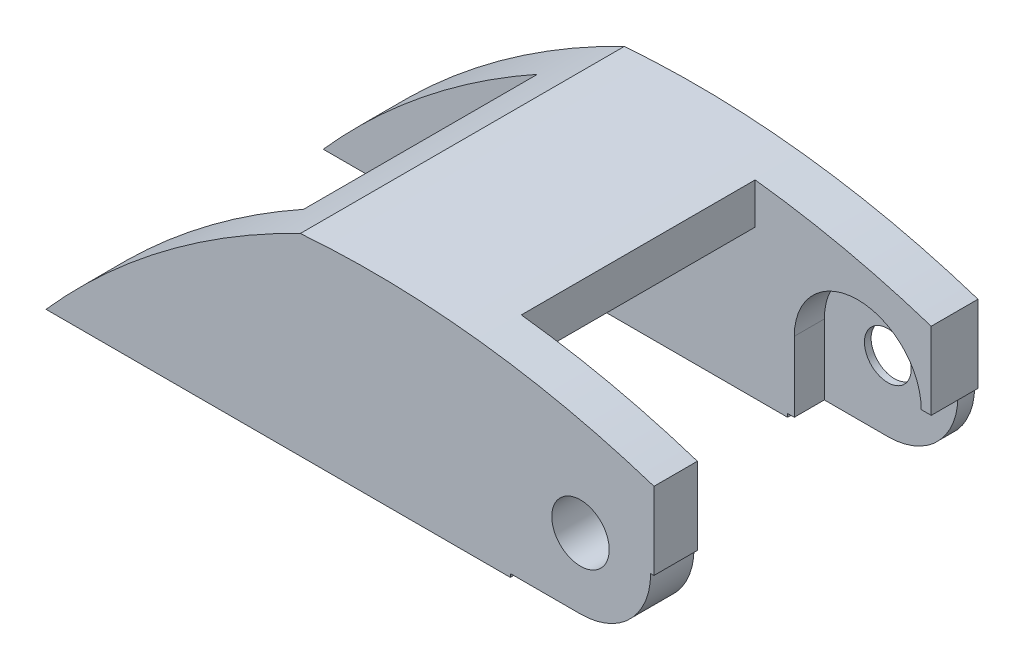
ISO-10303-21;
HEADER;
FILE_DESCRIPTION(('STEP AP214'),'2;1');
FILE_NAME('part.step','',(''),(''),'','','');
FILE_SCHEMA(('AUTOMOTIVE_DESIGN { 1 0 10303 214 1 1 1 1 }'));
ENDSEC;
DATA;
#1=APPLICATION_CONTEXT('core data for automotive mechanical design processes');
#2=APPLICATION_PROTOCOL_DEFINITION('international standard','automotive_design',2000,#1);
#3=PRODUCT_CONTEXT('',#1,'mechanical');
#4=PRODUCT('Part','Part','',(#3));
#5=PRODUCT_RELATED_PRODUCT_CATEGORY('part','',(#4));
#6=PRODUCT_DEFINITION_FORMATION('','',#4);
#7=PRODUCT_DEFINITION_CONTEXT('part definition',#1,'design');
#8=PRODUCT_DEFINITION('design','',#6,#7);
#9=PRODUCT_DEFINITION_SHAPE('','',#8);
#10=(LENGTH_UNIT() NAMED_UNIT(*) SI_UNIT(.MILLI.,.METRE.));
#11=(NAMED_UNIT(*) PLANE_ANGLE_UNIT() SI_UNIT($,.RADIAN.));
#12=(NAMED_UNIT(*) SI_UNIT($,.STERADIAN.) SOLID_ANGLE_UNIT());
#13=UNCERTAINTY_MEASURE_WITH_UNIT(LENGTH_MEASURE(1.E-05),#10,'distance_accuracy_value','');
#14=(GEOMETRIC_REPRESENTATION_CONTEXT(3) GLOBAL_UNCERTAINTY_ASSIGNED_CONTEXT((#13)) GLOBAL_UNIT_ASSIGNED_CONTEXT((#10,
#11,#12)) REPRESENTATION_CONTEXT('',''));
#15=CARTESIAN_POINT('',(0.,0.,0.));
#16=DIRECTION('',(0.,0.,1.));
#17=DIRECTION('',(1.,0.,0.));
#18=AXIS2_PLACEMENT_3D('',#15,#16,#17);
#19=CARTESIAN_POINT('',(0.,0.,-75.3));
#20=DIRECTION('',(0.,0.,-1.));
#21=DIRECTION('',(-1.,0.,0.));
#22=AXIS2_PLACEMENT_3D('',#19,#20,#21);
#23=CYLINDRICAL_SURFACE('',#22,3.5);
#24=CARTESIAN_POINT('',(0.,0.,-94.5));
#25=DIRECTION('',(0.,0.,1.));
#26=DIRECTION('',(0.,-1.,0.));
#27=AXIS2_PLACEMENT_3D('',#24,#25,#26);
#28=CIRCLE('',#27,3.5);
#29=CARTESIAN_POINT('',(0.,-3.5,-94.5));
#30=VERTEX_POINT('',#29);
#31=EDGE_CURVE('E53',#30,#30,#28,.T.);
#32=ORIENTED_EDGE('',*,*,#31,.T.);
#33=EDGE_LOOP('',(#32));
#34=FACE_BOUND('',#33,.T.);
#35=CARTESIAN_POINT('',(0.,0.,-95.5));
#36=DIRECTION('',(0.,0.,-1.));
#37=DIRECTION('',(-1.,0.,0.));
#38=AXIS2_PLACEMENT_3D('',#35,#36,#37);
#39=CIRCLE('',#38,3.5);
#40=CARTESIAN_POINT('',(-3.5,0.,-95.5));
#41=VERTEX_POINT('',#40);
#42=EDGE_CURVE('E234',#41,#41,#39,.F.);
#43=ORIENTED_EDGE('',*,*,#42,.F.);
#44=EDGE_LOOP('',(#43));
#45=FACE_BOUND('',#44,.T.);
#46=ADVANCED_FACE('F49',(#34,#45),#23,.F.);
#47=CARTESIAN_POINT('',(0.,-11.,-90.));
#48=DIRECTION('',(0.,1.,0.));
#49=DIRECTION('',(-1.,0.,0.));
#50=AXIS2_PLACEMENT_3D('',#47,#48,#49);
#51=PLANE('',#50);
#52=DIRECTION('',(0.,0.,-1.));
#53=VECTOR('',#52,1.);
#54=CARTESIAN_POINT('',(-10.5,-11.,-48.5));
#55=LINE('',#54,#53);
#56=CARTESIAN_POINT('',(-10.5,-11.,-48.5));
#57=VERTEX_POINT('',#56);
#58=CARTESIAN_POINT('',(-10.5,-11.,-55.));
#59=VERTEX_POINT('',#58);
#60=EDGE_CURVE('E352',#57,#59,#55,.T.);
#61=ORIENTED_EDGE('',*,*,#60,.F.);
#62=DIRECTION('',(-1.,0.,0.));
#63=VECTOR('',#62,1.);
#64=CARTESIAN_POINT('',(0.,-11.,-48.5));
#65=LINE('',#64,#63);
#66=CARTESIAN_POINT('',(-80.,-11.,-48.5));
#67=VERTEX_POINT('',#66);
#68=EDGE_CURVE('E444',#57,#67,#65,.T.);
#69=ORIENTED_EDGE('',*,*,#68,.T.);
#70=DIRECTION('',(0.,0.,-1.));
#71=VECTOR('',#70,1.);
#72=CARTESIAN_POINT('',(-80.,-11.,-90.));
#73=LINE('',#72,#71);
#74=CARTESIAN_POINT('',(-80.,-11.,-55.));
#75=VERTEX_POINT('',#74);
#76=EDGE_CURVE('E458',#67,#75,#73,.T.);
#77=ORIENTED_EDGE('',*,*,#76,.T.);
#78=DIRECTION('',(1.,0.,0.));
#79=VECTOR('',#78,1.);
#80=CARTESIAN_POINT('',(0.,-11.,-55.));
#81=LINE('',#80,#79);
#82=EDGE_CURVE('E436',#75,#59,#81,.T.);
#83=ORIENTED_EDGE('',*,*,#82,.T.);
#84=EDGE_LOOP('',(#61,#69,#77,#83));
#85=FACE_BOUND('',#84,.T.);
#86=ADVANCED_FACE('F531',(#85),#51,.F.);
#87=CARTESIAN_POINT('',(12.,-12.,-90.));
#88=DIRECTION('',(0.,0.,-1.));
#89=DIRECTION('',(0.,-1.,0.));
#90=AXIS2_PLACEMENT_3D('',#87,#88,#89);
#91=PLANE('',#90);
#92=CARTESIAN_POINT('',(0.,0.,-90.));
#93=DIRECTION('',(0.,0.,-1.));
#94=DIRECTION('',(0.,1.,0.));
#95=AXIS2_PLACEMENT_3D('',#92,#93,#94);
#96=CIRCLE('',#95,9.5);
#97=CARTESIAN_POINT('',(-9.5,0.,-90.));
#98=VERTEX_POINT('',#97);
#99=CARTESIAN_POINT('',(9.5,0.,-90.));
#100=VERTEX_POINT('',#99);
#101=EDGE_CURVE('E480',#98,#100,#96,.T.);
#102=ORIENTED_EDGE('',*,*,#101,.T.);
#103=DIRECTION('',(-1.,0.,0.));
#104=VECTOR('',#103,1.);
#105=CARTESIAN_POINT('',(12.,0.,-90.));
#106=LINE('',#105,#104);
#107=CARTESIAN_POINT('',(11.,0.,-90.));
#108=VERTEX_POINT('',#107);
#109=EDGE_CURVE('E369',#108,#100,#106,.T.);
#110=ORIENTED_EDGE('',*,*,#109,.F.);
#111=DIRECTION('',(0.,-1.,0.));
#112=VECTOR('',#111,1.);
#113=CARTESIAN_POINT('',(11.,-12.,-90.));
#114=LINE('',#113,#112);
#115=CARTESIAN_POINT('',(11.,11.56,-90.));
#116=VERTEX_POINT('',#115);
#117=EDGE_CURVE('E475',#116,#108,#114,.T.);
#118=ORIENTED_EDGE('',*,*,#117,.F.);
#119=CARTESIAN_POINT('',(-31.2492235347199,-117.890366828592,-90.));
#120=DIRECTION('',(0.,0.,-1.));
#121=DIRECTION('',(-1.,0.,0.));
#122=AXIS2_PLACEMENT_3D('',#119,#120,#121);
#123=CIRCLE('',#122,136.170460678312);
#124=CARTESIAN_POINT('',(-15.3528796517891,17.3490527668032,-90.));
#125=VERTEX_POINT('',#124);
#126=EDGE_CURVE('E403',#116,#125,#123,.F.);
#127=ORIENTED_EDGE('',*,*,#126,.T.);
#128=DIRECTION('',(0.,1.,0.));
#129=VECTOR('',#128,1.);
#130=CARTESIAN_POINT('',(-15.3528796517891,27.0048203954215,-90.));
#131=LINE('',#130,#129);
#132=CARTESIAN_POINT('',(-15.3528796517891,11.2297104142764,-90.));
#133=VERTEX_POINT('',#132);
#134=EDGE_CURVE('E380',#133,#125,#131,.T.);
#135=ORIENTED_EDGE('',*,*,#134,.F.);
#136=DIRECTION('',(-0.999921466953452,-0.0125323551520775,0.));
#137=VECTOR('',#136,1.);
#138=CARTESIAN_POINT('',(11.7046038405384,11.5688310390996,-90.));
#139=LINE('',#138,#137);
#140=CARTESIAN_POINT('',(-47.9438251540047,10.8212370318415,-90.));
#141=VERTEX_POINT('',#140);
#142=EDGE_CURVE('E414',#133,#141,#139,.T.);
#143=ORIENTED_EDGE('',*,*,#142,.T.);
#144=DIRECTION('',(0.,-1.,0.));
#145=VECTOR('',#144,1.);
#146=CARTESIAN_POINT('',(-47.9438251540047,23.2476872678202,-90.));
#147=LINE('',#146,#145);
#148=CARTESIAN_POINT('',(-47.9438251540047,14.7426625515026,-90.));
#149=VERTEX_POINT('',#148);
#150=EDGE_CURVE('E375',#149,#141,#147,.T.);
#151=ORIENTED_EDGE('',*,*,#150,.F.);
#152=CARTESIAN_POINT('',(11.,-91.4878048780488,-90.));
#153=DIRECTION('',(0.,0.,-1.));
#154=DIRECTION('',(-1.,0.,0.));
#155=AXIS2_PLACEMENT_3D('',#152,#153,#154);
#156=CIRCLE('',#155,121.487804878049);
#157=CARTESIAN_POINT('',(-80.,-11.,-90.));
#158=VERTEX_POINT('',#157);
#159=EDGE_CURVE('E392',#158,#149,#156,.T.);
#160=ORIENTED_EDGE('',*,*,#159,.F.);
#161=DIRECTION('',(-1.,0.,0.));
#162=VECTOR('',#161,1.);
#163=CARTESIAN_POINT('',(0.,-11.,-90.));
#164=LINE('',#163,#162);
#165=CARTESIAN_POINT('',(-10.5,-11.,-90.));
#166=VERTEX_POINT('',#165);
#167=EDGE_CURVE('E448',#166,#158,#164,.T.);
#168=ORIENTED_EDGE('',*,*,#167,.F.);
#169=DIRECTION('',(0.,-1.,0.));
#170=VECTOR('',#169,1.);
#171=CARTESIAN_POINT('',(-10.5,-12.,-90.));
#172=LINE('',#171,#170);
#173=CARTESIAN_POINT('',(-10.5,-10.5,-90.));
#174=VERTEX_POINT('',#173);
#175=EDGE_CURVE('E362',#174,#166,#172,.T.);
#176=ORIENTED_EDGE('',*,*,#175,.F.);
#177=DIRECTION('',(-1.,0.,0.));
#178=VECTOR('',#177,1.);
#179=CARTESIAN_POINT('',(12.,-10.5,-90.));
#180=LINE('',#179,#178);
#181=CARTESIAN_POINT('',(-9.5,-10.5,-90.));
#182=VERTEX_POINT('',#181);
#183=EDGE_CURVE('E372',#182,#174,#180,.T.);
#184=ORIENTED_EDGE('',*,*,#183,.F.);
#185=DIRECTION('',(0.,1.,0.));
#186=VECTOR('',#185,1.);
#187=CARTESIAN_POINT('',(-9.5,-12.,-90.));
#188=LINE('',#187,#186);
#189=EDGE_CURVE('E303',#182,#98,#188,.T.);
#190=ORIENTED_EDGE('',*,*,#189,.T.);
#191=EDGE_LOOP('',(#102,#110,#118,#127,#135,#143,#151,#160,#168,#176,#184,#190));
#192=FACE_BOUND('',#191,.T.);
#193=ADVANCED_FACE('F594',(#192),#91,.F.);
#194=CARTESIAN_POINT('',(0.,0.,-97.));
#195=DIRECTION('',(0.,0.,-1.));
#196=DIRECTION('',(1.,0.,0.));
#197=AXIS2_PLACEMENT_3D('',#194,#195,#196);
#198=PLANE('',#197);
#199=CARTESIAN_POINT('',(0.,0.,-97.));
#200=DIRECTION('',(0.,0.,-1.));
#201=DIRECTION('',(-1.,0.,0.));
#202=AXIS2_PLACEMENT_3D('',#199,#200,#201);
#203=CIRCLE('',#202,6.);
#204=CARTESIAN_POINT('',(0.,6.,-97.));
#205=VERTEX_POINT('',#204);
#206=CARTESIAN_POINT('',(0.,-6.,-97.));
#207=VERTEX_POINT('',#206);
#208=EDGE_CURVE('E67',#205,#207,#203,.T.);
#209=ORIENTED_EDGE('',*,*,#208,.F.);
#210=DIRECTION('',(-1.,0.,0.));
#211=VECTOR('',#210,1.);
#212=CARTESIAN_POINT('',(0.,6.,-97.));
#213=LINE('',#212,#211);
#214=CARTESIAN_POINT('',(-25.,6.,-97.));
#215=VERTEX_POINT('',#214);
#216=EDGE_CURVE('E250',#205,#215,#213,.T.);
#217=ORIENTED_EDGE('',*,*,#216,.T.);
#218=DIRECTION('',(0.,-1.,0.));
#219=VECTOR('',#218,1.);
#220=CARTESIAN_POINT('',(-25.,0.,-97.));
#221=LINE('',#220,#219);
#222=CARTESIAN_POINT('',(-25.,-6.,-97.));
#223=VERTEX_POINT('',#222);
#224=EDGE_CURVE('E254',#215,#223,#221,.T.);
#225=ORIENTED_EDGE('',*,*,#224,.T.);
#226=DIRECTION('',(-1.,0.,0.));
#227=VECTOR('',#226,1.);
#228=CARTESIAN_POINT('',(0.,-6.,-97.));
#229=LINE('',#228,#227);
#230=EDGE_CURVE('E266',#207,#223,#229,.T.);
#231=ORIENTED_EDGE('',*,*,#230,.F.);
#232=EDGE_LOOP('',(#209,#217,#225,#231));
#233=FACE_BOUND('',#232,.T.);
#234=DIRECTION('',(-1.,0.,0.));
#235=VECTOR('',#234,1.);
#236=CARTESIAN_POINT('',(0.,-10.5,-97.));
#237=LINE('',#236,#235);
#238=CARTESIAN_POINT('',(0.,-10.5,-97.));
#239=VERTEX_POINT('',#238);
#240=CARTESIAN_POINT('',(-10.5,-10.5,-97.));
#241=VERTEX_POINT('',#240);
#242=EDGE_CURVE('E316',#239,#241,#237,.T.);
#243=ORIENTED_EDGE('',*,*,#242,.T.);
#244=DIRECTION('',(0.,-1.,0.));
#245=VECTOR('',#244,1.);
#246=CARTESIAN_POINT('',(-10.5,0.,-97.));
#247=LINE('',#246,#245);
#248=CARTESIAN_POINT('',(-10.5,-11.,-97.));
#249=VERTEX_POINT('',#248);
#250=EDGE_CURVE('E334',#241,#249,#247,.T.);
#251=ORIENTED_EDGE('',*,*,#250,.T.);
#252=DIRECTION('',(-1.,0.,0.));
#253=VECTOR('',#252,1.);
#254=CARTESIAN_POINT('',(0.,-11.,-97.));
#255=LINE('',#254,#253);
#256=CARTESIAN_POINT('',(-80.,-11.,-97.));
#257=VERTEX_POINT('',#256);
#258=EDGE_CURVE('E452',#249,#257,#255,.T.);
#259=ORIENTED_EDGE('',*,*,#258,.T.);
#260=CARTESIAN_POINT('',(11.,-91.4878048780488,-97.));
#261=DIRECTION('',(0.,0.,1.));
#262=DIRECTION('',(1.,0.,0.));
#263=AXIS2_PLACEMENT_3D('',#260,#261,#262);
#264=CIRCLE('',#263,121.487804878049);
#265=CARTESIAN_POINT('',(-41.9371731625238,17.86,-97.));
#266=VERTEX_POINT('',#265);
#267=EDGE_CURVE('E447',#257,#266,#264,.F.);
#268=ORIENTED_EDGE('',*,*,#267,.T.);
#269=CARTESIAN_POINT('',(-31.2492235347199,-117.890366828592,-97.));
#270=DIRECTION('',(0.,0.,1.));
#271=DIRECTION('',(1.,0.,0.));
#272=AXIS2_PLACEMENT_3D('',#269,#270,#271);
#273=CIRCLE('',#272,136.170460678312);
#274=CARTESIAN_POINT('',(11.,11.56,-97.));
#275=VERTEX_POINT('',#274);
#276=EDGE_CURVE('E419',#275,#266,#273,.T.);
#277=ORIENTED_EDGE('',*,*,#276,.F.);
#278=DIRECTION('',(0.,-1.,0.));
#279=VECTOR('',#278,1.);
#280=CARTESIAN_POINT('',(11.,0.,-97.));
#281=LINE('',#280,#279);
#282=CARTESIAN_POINT('',(11.,0.,-97.));
#283=VERTEX_POINT('',#282);
#284=EDGE_CURVE('E462',#275,#283,#281,.T.);
#285=ORIENTED_EDGE('',*,*,#284,.T.);
#286=DIRECTION('',(-1.,0.,0.));
#287=VECTOR('',#286,1.);
#288=CARTESIAN_POINT('',(0.,0.,-97.));
#289=LINE('',#288,#287);
#290=CARTESIAN_POINT('',(10.5,0.,-97.));
#291=VERTEX_POINT('',#290);
#292=EDGE_CURVE('E330',#283,#291,#289,.T.);
#293=ORIENTED_EDGE('',*,*,#292,.T.);
#294=CARTESIAN_POINT('',(0.,0.,-97.));
#295=DIRECTION('',(0.,0.,-1.));
#296=DIRECTION('',(-1.,0.,0.));
#297=AXIS2_PLACEMENT_3D('',#294,#295,#296);
#298=CIRCLE('',#297,10.5);
#299=EDGE_CURVE('E326',#291,#239,#298,.T.);
#300=ORIENTED_EDGE('',*,*,#299,.T.);
#301=EDGE_LOOP('',(#243,#251,#259,#268,#277,#285,#293,#300));
#302=FACE_BOUND('',#301,.T.);
#303=ADVANCED_FACE('F572',(#233,#302),#198,.T.);
#304=CARTESIAN_POINT('',(0.,0.,-48.5));
#305=DIRECTION('',(0.,0.,1.));
#306=DIRECTION('',(-1.,0.,0.));
#307=AXIS2_PLACEMENT_3D('',#304,#305,#306);
#308=PLANE('',#307);
#309=CARTESIAN_POINT('',(0.,0.,-48.5));
#310=DIRECTION('',(0.,0.,-1.));
#311=DIRECTION('',(-1.,0.,0.));
#312=AXIS2_PLACEMENT_3D('',#309,#310,#311);
#313=CIRCLE('',#312,4.3);
#314=CARTESIAN_POINT('',(-4.3,0.,-48.5));
#315=VERTEX_POINT('',#314);
#316=EDGE_CURVE('E307',#315,#315,#313,.T.);
#317=ORIENTED_EDGE('',*,*,#316,.T.);
#318=EDGE_LOOP('',(#317));
#319=FACE_BOUND('',#318,.T.);
#320=ORIENTED_EDGE('',*,*,#68,.F.);
#321=DIRECTION('',(0.,-1.,0.));
#322=VECTOR('',#321,1.);
#323=CARTESIAN_POINT('',(-10.5,0.,-48.5));
#324=LINE('',#323,#322);
#325=CARTESIAN_POINT('',(-10.5,-10.5,-48.5));
#326=VERTEX_POINT('',#325);
#327=EDGE_CURVE('E319',#326,#57,#324,.T.);
#328=ORIENTED_EDGE('',*,*,#327,.F.);
#329=DIRECTION('',(-1.,0.,0.));
#330=VECTOR('',#329,1.);
#331=CARTESIAN_POINT('',(0.,-10.5,-48.5));
#332=LINE('',#331,#330);
#333=CARTESIAN_POINT('',(0.,-10.5,-48.5));
#334=VERTEX_POINT('',#333);
#335=EDGE_CURVE('E322',#334,#326,#332,.T.);
#336=ORIENTED_EDGE('',*,*,#335,.F.);
#337=CARTESIAN_POINT('',(0.,0.,-48.5));
#338=DIRECTION('',(0.,0.,-1.));
#339=DIRECTION('',(-1.,0.,0.));
#340=AXIS2_PLACEMENT_3D('',#337,#338,#339);
#341=CIRCLE('',#340,10.5);
#342=CARTESIAN_POINT('',(10.5,0.,-48.5));
#343=VERTEX_POINT('',#342);
#344=EDGE_CURVE('E312',#343,#334,#341,.T.);
#345=ORIENTED_EDGE('',*,*,#344,.F.);
#346=DIRECTION('',(-1.,0.,0.));
#347=VECTOR('',#346,1.);
#348=CARTESIAN_POINT('',(0.,0.,-48.5));
#349=LINE('',#348,#347);
#350=CARTESIAN_POINT('',(11.,0.,-48.5));
#351=VERTEX_POINT('',#350);
#352=EDGE_CURVE('E315',#351,#343,#349,.T.);
#353=ORIENTED_EDGE('',*,*,#352,.F.);
#354=DIRECTION('',(0.,-1.,0.));
#355=VECTOR('',#354,1.);
#356=CARTESIAN_POINT('',(11.,0.,-48.5));
#357=LINE('',#356,#355);
#358=CARTESIAN_POINT('',(11.,11.56,-48.5));
#359=VERTEX_POINT('',#358);
#360=EDGE_CURVE('E463',#359,#351,#357,.T.);
#361=ORIENTED_EDGE('',*,*,#360,.F.);
#362=CARTESIAN_POINT('',(-31.2492235347199,-117.890366828592,-48.5));
#363=DIRECTION('',(0.,0.,1.));
#364=DIRECTION('',(1.,0.,0.));
#365=AXIS2_PLACEMENT_3D('',#362,#363,#364);
#366=CIRCLE('',#365,136.170460678312);
#367=CARTESIAN_POINT('',(-41.9371731625238,17.86,-48.5));
#368=VERTEX_POINT('',#367);
#369=EDGE_CURVE('E418',#359,#368,#366,.T.);
#370=ORIENTED_EDGE('',*,*,#369,.T.);
#371=CARTESIAN_POINT('',(11.,-91.4878048780488,-48.5));
#372=DIRECTION('',(0.,0.,1.));
#373=DIRECTION('',(1.,0.,0.));
#374=AXIS2_PLACEMENT_3D('',#371,#372,#373);
#375=CIRCLE('',#374,121.487804878049);
#376=EDGE_CURVE('E440',#67,#368,#375,.F.);
#377=ORIENTED_EDGE('',*,*,#376,.F.);
#378=EDGE_LOOP('',(#320,#328,#336,#345,#353,#361,#370,#377));
#379=FACE_BOUND('',#378,.T.);
#380=ADVANCED_FACE('F511',(#319,#379),#308,.T.);
#381=CARTESIAN_POINT('',(0.,0.,-55.));
#382=DIRECTION('',(0.,0.,-1.));
#383=DIRECTION('',(1.,0.,0.));
#384=AXIS2_PLACEMENT_3D('',#381,#382,#383);
#385=PLANE('',#384);
#386=CARTESIAN_POINT('',(0.,0.,-55.));
#387=DIRECTION('',(0.,0.,-1.));
#388=DIRECTION('',(-1.,0.,0.));
#389=AXIS2_PLACEMENT_3D('',#386,#387,#388);
#390=CIRCLE('',#389,4.3);
#391=CARTESIAN_POINT('',(-4.3,0.,-55.));
#392=VERTEX_POINT('',#391);
#393=EDGE_CURVE('E311',#392,#392,#390,.T.);
#394=ORIENTED_EDGE('',*,*,#393,.F.);
#395=EDGE_LOOP('',(#394));
#396=FACE_BOUND('',#395,.T.);
#397=DIRECTION('',(-1.,0.,0.));
#398=VECTOR('',#397,1.);
#399=CARTESIAN_POINT('',(0.,-10.5,-55.));
#400=LINE('',#399,#398);
#401=CARTESIAN_POINT('',(0.,-10.5,-55.));
#402=VERTEX_POINT('',#401);
#403=CARTESIAN_POINT('',(-10.5,-10.5,-55.));
#404=VERTEX_POINT('',#403);
#405=EDGE_CURVE('E11',#402,#404,#400,.T.);
#406=ORIENTED_EDGE('',*,*,#405,.T.);
#407=DIRECTION('',(0.,-1.,0.));
#408=VECTOR('',#407,1.);
#409=CARTESIAN_POINT('',(-10.5,0.,-55.));
#410=LINE('',#409,#408);
#411=EDGE_CURVE('E345',#404,#59,#410,.T.);
#412=ORIENTED_EDGE('',*,*,#411,.T.);
#413=ORIENTED_EDGE('',*,*,#82,.F.);
#414=CARTESIAN_POINT('',(11.,-91.4878048780488,-55.));
#415=DIRECTION('',(0.,0.,-1.));
#416=DIRECTION('',(-1.,0.,0.));
#417=AXIS2_PLACEMENT_3D('',#414,#415,#416);
#418=CIRCLE('',#417,121.487804878049);
#419=CARTESIAN_POINT('',(-47.9438251540047,14.7426625515026,-55.));
#420=VERTEX_POINT('',#419);
#421=EDGE_CURVE('E385',#75,#420,#418,.T.);
#422=ORIENTED_EDGE('',*,*,#421,.T.);
#423=DIRECTION('',(0.,-1.,0.));
#424=VECTOR('',#423,1.);
#425=CARTESIAN_POINT('',(-47.9438251540047,23.2476872678202,-55.));
#426=LINE('',#425,#424);
#427=CARTESIAN_POINT('',(-47.9438251540047,10.8212370318415,-55.));
#428=VERTEX_POINT('',#427);
#429=EDGE_CURVE('E381',#420,#428,#426,.T.);
#430=ORIENTED_EDGE('',*,*,#429,.T.);
#431=DIRECTION('',(-0.999921466953452,-0.0125323551520775,0.));
#432=VECTOR('',#431,1.);
#433=CARTESIAN_POINT('',(-0.143134988977188,11.4203393068309,-55.));
#434=LINE('',#433,#432);
#435=CARTESIAN_POINT('',(-15.3528796517891,11.2297104142764,-55.));
#436=VERTEX_POINT('',#435);
#437=EDGE_CURVE('E410',#436,#428,#434,.T.);
#438=ORIENTED_EDGE('',*,*,#437,.F.);
#439=DIRECTION('',(0.,1.,0.));
#440=VECTOR('',#439,1.);
#441=CARTESIAN_POINT('',(-15.3528796517891,27.0048203954215,-55.));
#442=LINE('',#441,#440);
#443=CARTESIAN_POINT('',(-15.3528796517891,17.3490527668032,-55.));
#444=VERTEX_POINT('',#443);
#445=EDGE_CURVE('E376',#436,#444,#442,.T.);
#446=ORIENTED_EDGE('',*,*,#445,.T.);
#447=CARTESIAN_POINT('',(-31.2492235347199,-117.890366828592,-55.));
#448=DIRECTION('',(0.,0.,-1.));
#449=DIRECTION('',(-1.,0.,0.));
#450=AXIS2_PLACEMENT_3D('',#447,#448,#449);
#451=CIRCLE('',#450,136.170460678312);
#452=CARTESIAN_POINT('',(11.,11.56,-55.));
#453=VERTEX_POINT('',#452);
#454=EDGE_CURVE('E399',#453,#444,#451,.F.);
#455=ORIENTED_EDGE('',*,*,#454,.F.);
#456=DIRECTION('',(0.,1.,0.));
#457=VECTOR('',#456,1.);
#458=CARTESIAN_POINT('',(11.,0.,-55.));
#459=LINE('',#458,#457);
#460=CARTESIAN_POINT('',(11.,0.,-55.));
#461=VERTEX_POINT('',#460);
#462=EDGE_CURVE('E429',#461,#453,#459,.T.);
#463=ORIENTED_EDGE('',*,*,#462,.F.);
#464=DIRECTION('',(-1.,0.,0.));
#465=VECTOR('',#464,1.);
#466=CARTESIAN_POINT('',(0.,0.,-55.));
#467=LINE('',#466,#465);
#468=CARTESIAN_POINT('',(10.5,0.,-55.));
#469=VERTEX_POINT('',#468);
#470=EDGE_CURVE('E365',#461,#469,#467,.T.);
#471=ORIENTED_EDGE('',*,*,#470,.T.);
#472=CARTESIAN_POINT('',(0.,0.,-55.));
#473=DIRECTION('',(0.,0.,-1.));
#474=DIRECTION('',(-1.,0.,0.));
#475=AXIS2_PLACEMENT_3D('',#472,#473,#474);
#476=CIRCLE('',#475,10.5);
#477=EDGE_CURVE('E59',#469,#402,#476,.T.);
#478=ORIENTED_EDGE('',*,*,#477,.T.);
#479=EDGE_LOOP('',(#406,#412,#413,#422,#430,#438,#446,#455,#463,#471,#478));
#480=FACE_BOUND('',#479,.T.);
#481=ADVANCED_FACE('F507',(#396,#480),#385,.T.);
#482=DIRECTION('',(0.,0.,-1.));
#483=VECTOR('',#482,1.);
#484=CARTESIAN_POINT('',(-10.5,-11.,-90.));
#485=LINE('',#484,#483);
#486=EDGE_CURVE('E495',#166,#249,#485,.T.);
#487=ORIENTED_EDGE('',*,*,#486,.F.);
#488=ORIENTED_EDGE('',*,*,#167,.T.);
#489=EDGE_CURVE('E451',#158,#257,#73,.T.);
#490=ORIENTED_EDGE('',*,*,#489,.T.);
#491=ORIENTED_EDGE('',*,*,#258,.F.);
#492=EDGE_LOOP('',(#487,#488,#490,#491));
#493=FACE_BOUND('',#492,.T.);
#494=ADVANCED_FACE('F510',(#493),#51,.F.);
#495=CARTESIAN_POINT('',(-0.143134988977188,11.4203393068309,-52.75));
#496=DIRECTION('',(0.0125323551520775,-0.999921466953451,0.));
#497=DIRECTION('',(0.999921466953452,0.0125323551520775,0.));
#498=AXIS2_PLACEMENT_3D('',#495,#496,#497);
#499=PLANE('',#498);
#500=ORIENTED_EDGE('',*,*,#142,.F.);
#501=DIRECTION('',(0.,0.,1.));
#502=VECTOR('',#501,1.);
#503=CARTESIAN_POINT('',(-15.3528796517891,11.2297104142764,-52.75));
#504=LINE('',#503,#502);
#505=EDGE_CURVE('E491',#133,#436,#504,.T.);
#506=ORIENTED_EDGE('',*,*,#505,.T.);
#507=ORIENTED_EDGE('',*,*,#437,.T.);
#508=DIRECTION('',(0.,0.,-1.));
#509=VECTOR('',#508,1.);
#510=CARTESIAN_POINT('',(-47.9438251540047,10.8212370318415,-52.75));
#511=LINE('',#510,#509);
#512=EDGE_CURVE('E484',#428,#141,#511,.T.);
#513=ORIENTED_EDGE('',*,*,#512,.T.);
#514=EDGE_LOOP('',(#500,#506,#507,#513));
#515=FACE_BOUND('',#514,.T.);
#516=ADVANCED_FACE('F550',(#515),#499,.T.);
#517=CARTESIAN_POINT('',(11.,0.,-48.5));
#518=DIRECTION('',(-1.,0.,0.));
#519=DIRECTION('',(0.,0.,-1.));
#520=AXIS2_PLACEMENT_3D('',#517,#518,#519);
#521=PLANE('',#520);
#522=DIRECTION('',(0.,0.,1.));
#523=VECTOR('',#522,1.);
#524=CARTESIAN_POINT('',(11.,11.56,-97.));
#525=LINE('',#524,#523);
#526=EDGE_CURVE('E422',#453,#359,#525,.T.);
#527=ORIENTED_EDGE('',*,*,#526,.T.);
#528=ORIENTED_EDGE('',*,*,#360,.T.);
#529=DIRECTION('',(0.,0.,-1.));
#530=VECTOR('',#529,1.);
#531=CARTESIAN_POINT('',(11.,0.,-48.5));
#532=LINE('',#531,#530);
#533=EDGE_CURVE('E471',#351,#461,#532,.T.);
#534=ORIENTED_EDGE('',*,*,#533,.T.);
#535=ORIENTED_EDGE('',*,*,#462,.T.);
#536=EDGE_LOOP('',(#527,#528,#534,#535));
#537=FACE_BOUND('',#536,.T.);
#538=ADVANCED_FACE('F665',(#537),#521,.F.);
#539=EDGE_CURVE('E430',#275,#116,#525,.T.);
#540=ORIENTED_EDGE('',*,*,#539,.T.);
#541=ORIENTED_EDGE('',*,*,#117,.T.);
#542=EDGE_CURVE('E467',#108,#283,#532,.T.);
#543=ORIENTED_EDGE('',*,*,#542,.T.);
#544=ORIENTED_EDGE('',*,*,#284,.F.);
#545=EDGE_LOOP('',(#540,#541,#543,#544));
#546=FACE_BOUND('',#545,.T.);
#547=ADVANCED_FACE('F577',(#546),#521,.F.);
#548=CARTESIAN_POINT('',(11.,-91.4878048780488,-90.));
#549=DIRECTION('',(0.,0.,-1.));
#550=DIRECTION('',(1.,0.,0.));
#551=AXIS2_PLACEMENT_3D('',#548,#549,#550);
#552=CYLINDRICAL_SURFACE('',#551,121.487804878049);
#553=ORIENTED_EDGE('',*,*,#489,.F.);
#554=ORIENTED_EDGE('',*,*,#159,.T.);
#555=DIRECTION('',(0.,0.,-1.));
#556=VECTOR('',#555,1.);
#557=CARTESIAN_POINT('',(-47.9438251540047,14.7426625515026,-90.));
#558=LINE('',#557,#556);
#559=EDGE_CURVE('E396',#420,#149,#558,.T.);
#560=ORIENTED_EDGE('',*,*,#559,.F.);
#561=ORIENTED_EDGE('',*,*,#421,.F.);
#562=ORIENTED_EDGE('',*,*,#76,.F.);
#563=ORIENTED_EDGE('',*,*,#376,.T.);
#564=DIRECTION('',(0.,0.,1.));
#565=VECTOR('',#564,1.);
#566=CARTESIAN_POINT('',(-41.9371731625238,17.86,-97.));
#567=LINE('',#566,#565);
#568=EDGE_CURVE('E426',#266,#368,#567,.T.);
#569=ORIENTED_EDGE('',*,*,#568,.F.);
#570=ORIENTED_EDGE('',*,*,#267,.F.);
#571=EDGE_LOOP('',(#553,#554,#560,#561,#562,#563,#569,#570));
#572=FACE_BOUND('',#571,.T.);
#573=ADVANCED_FACE('F538',(#572),#552,.T.);
#574=CARTESIAN_POINT('',(0.,0.,-94.5));
#575=DIRECTION('',(0.,0.,1.));
#576=DIRECTION('',(0.,1.,0.));
#577=AXIS2_PLACEMENT_3D('',#574,#575,#576);
#578=PLANE('',#577);
#579=ORIENTED_EDGE('',*,*,#31,.F.);
#580=EDGE_LOOP('',(#579));
#581=FACE_BOUND('',#580,.T.);
#582=CARTESIAN_POINT('',(0.,0.,-94.5));
#583=DIRECTION('',(0.,0.,-1.));
#584=DIRECTION('',(0.,1.,0.));
#585=AXIS2_PLACEMENT_3D('',#582,#583,#584);
#586=CIRCLE('',#585,9.5);
#587=CARTESIAN_POINT('',(-9.5,0.,-94.5));
#588=VERTEX_POINT('',#587);
#589=CARTESIAN_POINT('',(9.5,0.,-94.5));
#590=VERTEX_POINT('',#589);
#591=EDGE_CURVE('E479',#588,#590,#586,.T.);
#592=ORIENTED_EDGE('',*,*,#591,.F.);
#593=DIRECTION('',(0.,-1.,0.));
#594=VECTOR('',#593,1.);
#595=CARTESIAN_POINT('',(-9.5,0.,-94.5));
#596=LINE('',#595,#594);
#597=CARTESIAN_POINT('',(-9.5,-10.5,-94.5));
#598=VERTEX_POINT('',#597);
#599=EDGE_CURVE('E289',#588,#598,#596,.T.);
#600=ORIENTED_EDGE('',*,*,#599,.T.);
#601=DIRECTION('',(-1.,0.,0.));
#602=VECTOR('',#601,1.);
#603=CARTESIAN_POINT('',(0.,-10.5,-94.5));
#604=LINE('',#603,#602);
#605=CARTESIAN_POINT('',(0.,-10.5,-94.5));
#606=VERTEX_POINT('',#605);
#607=EDGE_CURVE('E75',#606,#598,#604,.T.);
#608=ORIENTED_EDGE('',*,*,#607,.F.);
#609=CARTESIAN_POINT('',(0.,0.,-94.5));
#610=DIRECTION('',(0.,0.,-1.));
#611=DIRECTION('',(-1.,0.,0.));
#612=AXIS2_PLACEMENT_3D('',#609,#610,#611);
#613=CIRCLE('',#612,10.5);
#614=CARTESIAN_POINT('',(10.5,0.,-94.5));
#615=VERTEX_POINT('',#614);
#616=EDGE_CURVE('E284',#615,#606,#613,.T.);
#617=ORIENTED_EDGE('',*,*,#616,.F.);
#618=DIRECTION('',(-1.,0.,0.));
#619=VECTOR('',#618,1.);
#620=CARTESIAN_POINT('',(0.,0.,-94.5));
#621=LINE('',#620,#619);
#622=EDGE_CURVE('E280',#615,#590,#621,.T.);
#623=ORIENTED_EDGE('',*,*,#622,.T.);
#624=EDGE_LOOP('',(#592,#600,#608,#617,#623));
#625=FACE_BOUND('',#624,.T.);
#626=ADVANCED_FACE('F51',(#581,#625),#578,.T.);
#627=CARTESIAN_POINT('',(0.,0.,-94.5));
#628=DIRECTION('',(0.,0.,1.));
#629=DIRECTION('',(0.,1.,0.));
#630=AXIS2_PLACEMENT_3D('',#627,#628,#629);
#631=CYLINDRICAL_SURFACE('',#630,9.5);
#632=ORIENTED_EDGE('',*,*,#591,.T.);
#633=DIRECTION('',(0.,0.,1.));
#634=VECTOR('',#633,1.);
#635=CARTESIAN_POINT('',(9.5,0.,-94.5));
#636=LINE('',#635,#634);
#637=EDGE_CURVE('E292',#590,#100,#636,.T.);
#638=ORIENTED_EDGE('',*,*,#637,.T.);
#639=ORIENTED_EDGE('',*,*,#101,.F.);
#640=DIRECTION('',(0.,0.,1.));
#641=VECTOR('',#640,1.);
#642=CARTESIAN_POINT('',(-9.5,0.,-94.5));
#643=LINE('',#642,#641);
#644=EDGE_CURVE('E296',#588,#98,#643,.T.);
#645=ORIENTED_EDGE('',*,*,#644,.F.);
#646=EDGE_LOOP('',(#632,#638,#639,#645));
#647=FACE_BOUND('',#646,.T.);
#648=ADVANCED_FACE('F651',(#647),#631,.F.);
#649=CARTESIAN_POINT('',(-31.2492235347199,-117.890366828592,-97.));
#650=DIRECTION('',(0.,0.,1.));
#651=DIRECTION('',(1.,0.,0.));
#652=AXIS2_PLACEMENT_3D('',#649,#650,#651);
#653=CYLINDRICAL_SURFACE('',#652,136.170460678312);
#654=ORIENTED_EDGE('',*,*,#126,.F.);
#655=ORIENTED_EDGE('',*,*,#539,.F.);
#656=ORIENTED_EDGE('',*,*,#276,.T.);
#657=ORIENTED_EDGE('',*,*,#568,.T.);
#658=ORIENTED_EDGE('',*,*,#369,.F.);
#659=ORIENTED_EDGE('',*,*,#526,.F.);
#660=ORIENTED_EDGE('',*,*,#454,.T.);
#661=DIRECTION('',(0.,0.,1.));
#662=VECTOR('',#661,1.);
#663=CARTESIAN_POINT('',(-15.3528796517891,17.3490527668032,-97.));
#664=LINE('',#663,#662);
#665=EDGE_CURVE('E406',#444,#125,#664,.F.);
#666=ORIENTED_EDGE('',*,*,#665,.T.);
#667=EDGE_LOOP('',(#654,#655,#656,#657,#658,#659,#660,#666));
#668=FACE_BOUND('',#667,.T.);
#669=ADVANCED_FACE('F556',(#668),#653,.T.);
#670=CARTESIAN_POINT('',(-47.9438251540047,23.2476872678202,-90.));
#671=DIRECTION('',(-1.,0.,0.));
#672=DIRECTION('',(0.,0.,1.));
#673=AXIS2_PLACEMENT_3D('',#670,#671,#672);
#674=PLANE('',#673);
#675=ORIENTED_EDGE('',*,*,#559,.T.);
#676=ORIENTED_EDGE('',*,*,#150,.T.);
#677=ORIENTED_EDGE('',*,*,#512,.F.);
#678=ORIENTED_EDGE('',*,*,#429,.F.);
#679=EDGE_LOOP('',(#675,#676,#677,#678));
#680=FACE_BOUND('',#679,.T.);
#681=ADVANCED_FACE('F546',(#680),#674,.T.);
#682=CARTESIAN_POINT('',(-15.3528796517891,27.0048203954215,-90.));
#683=DIRECTION('',(1.,0.,0.));
#684=DIRECTION('',(0.,0.,-1.));
#685=AXIS2_PLACEMENT_3D('',#682,#683,#684);
#686=PLANE('',#685);
#687=ORIENTED_EDGE('',*,*,#445,.F.);
#688=ORIENTED_EDGE('',*,*,#505,.F.);
#689=ORIENTED_EDGE('',*,*,#134,.T.);
#690=ORIENTED_EDGE('',*,*,#665,.F.);
#691=EDGE_LOOP('',(#687,#688,#689,#690));
#692=FACE_BOUND('',#691,.T.);
#693=ADVANCED_FACE('F597',(#692),#686,.T.);
#694=CARTESIAN_POINT('',(-10.5,0.,-48.5));
#695=DIRECTION('',(1.,0.,0.));
#696=DIRECTION('',(0.,0.,-1.));
#697=AXIS2_PLACEMENT_3D('',#694,#695,#696);
#698=PLANE('',#697);
#699=ORIENTED_EDGE('',*,*,#175,.T.);
#700=ORIENTED_EDGE('',*,*,#486,.T.);
#701=ORIENTED_EDGE('',*,*,#250,.F.);
#702=DIRECTION('',(0.,0.,-1.));
#703=VECTOR('',#702,1.);
#704=CARTESIAN_POINT('',(-10.5,-10.5,-48.5));
#705=LINE('',#704,#703);
#706=EDGE_CURVE('E351',#174,#241,#705,.T.);
#707=ORIENTED_EDGE('',*,*,#706,.F.);
#708=EDGE_LOOP('',(#699,#700,#701,#707));
#709=FACE_BOUND('',#708,.T.);
#710=ADVANCED_FACE('F591',(#709),#698,.T.);
#711=CARTESIAN_POINT('',(0.,-10.5,-48.5));
#712=DIRECTION('',(0.,-1.,0.));
#713=DIRECTION('',(0.,0.,-1.));
#714=AXIS2_PLACEMENT_3D('',#711,#712,#713);
#715=PLANE('',#714);
#716=DIRECTION('',(0.,0.,1.));
#717=VECTOR('',#716,1.);
#718=CARTESIAN_POINT('',(-9.5,-10.5,-94.5));
#719=LINE('',#718,#717);
#720=EDGE_CURVE('E299',#598,#182,#719,.T.);
#721=ORIENTED_EDGE('',*,*,#720,.T.);
#722=ORIENTED_EDGE('',*,*,#183,.T.);
#723=ORIENTED_EDGE('',*,*,#706,.T.);
#724=ORIENTED_EDGE('',*,*,#242,.F.);
#725=DIRECTION('',(0.,0.,-1.));
#726=VECTOR('',#725,1.);
#727=CARTESIAN_POINT('',(0.,-10.5,-48.5));
#728=LINE('',#727,#726);
#729=EDGE_CURVE('E346',#606,#239,#728,.T.);
#730=ORIENTED_EDGE('',*,*,#729,.F.);
#731=ORIENTED_EDGE('',*,*,#607,.T.);
#732=EDGE_LOOP('',(#721,#722,#723,#724,#730,#731));
#733=FACE_BOUND('',#732,.T.);
#734=ADVANCED_FACE('F605',(#733),#715,.T.);
#735=CARTESIAN_POINT('',(0.,0.,-48.5));
#736=DIRECTION('',(0.,-1.,0.));
#737=DIRECTION('',(1.,0.,0.));
#738=AXIS2_PLACEMENT_3D('',#735,#736,#737);
#739=PLANE('',#738);
#740=ORIENTED_EDGE('',*,*,#109,.T.);
#741=ORIENTED_EDGE('',*,*,#637,.F.);
#742=ORIENTED_EDGE('',*,*,#622,.F.);
#743=DIRECTION('',(0.,0.,-1.));
#744=VECTOR('',#743,1.);
#745=CARTESIAN_POINT('',(10.5,0.,-48.5));
#746=LINE('',#745,#744);
#747=EDGE_CURVE('E325',#615,#291,#746,.T.);
#748=ORIENTED_EDGE('',*,*,#747,.T.);
#749=ORIENTED_EDGE('',*,*,#292,.F.);
#750=ORIENTED_EDGE('',*,*,#542,.F.);
#751=EDGE_LOOP('',(#740,#741,#742,#748,#749,#750));
#752=FACE_BOUND('',#751,.T.);
#753=ADVANCED_FACE('F566',(#752),#739,.T.);
#754=CARTESIAN_POINT('',(0.,0.,-48.5));
#755=DIRECTION('',(0.,0.,-1.));
#756=DIRECTION('',(-1.,0.,0.));
#757=AXIS2_PLACEMENT_3D('',#754,#755,#756);
#758=CYLINDRICAL_SURFACE('',#757,10.5);
#759=ORIENTED_EDGE('',*,*,#616,.T.);
#760=ORIENTED_EDGE('',*,*,#729,.T.);
#761=ORIENTED_EDGE('',*,*,#299,.F.);
#762=ORIENTED_EDGE('',*,*,#747,.F.);
#763=EDGE_LOOP('',(#759,#760,#761,#762));
#764=FACE_BOUND('',#763,.T.);
#765=ADVANCED_FACE('F568',(#764),#758,.T.);
#766=EDGE_CURVE('E355',#343,#469,#746,.T.);
#767=ORIENTED_EDGE('',*,*,#766,.F.);
#768=ORIENTED_EDGE('',*,*,#344,.T.);
#769=EDGE_CURVE('E341',#334,#402,#728,.T.);
#770=ORIENTED_EDGE('',*,*,#769,.T.);
#771=ORIENTED_EDGE('',*,*,#477,.F.);
#772=EDGE_LOOP('',(#767,#768,#770,#771));
#773=FACE_BOUND('',#772,.T.);
#774=ADVANCED_FACE('F520',(#773),#758,.T.);
#775=ORIENTED_EDGE('',*,*,#769,.F.);
#776=ORIENTED_EDGE('',*,*,#335,.T.);
#777=EDGE_CURVE('E347',#326,#404,#705,.T.);
#778=ORIENTED_EDGE('',*,*,#777,.T.);
#779=ORIENTED_EDGE('',*,*,#405,.F.);
#780=EDGE_LOOP('',(#775,#776,#778,#779));
#781=FACE_BOUND('',#780,.T.);
#782=ADVANCED_FACE('F515',(#781),#715,.T.);
#783=ORIENTED_EDGE('',*,*,#777,.F.);
#784=ORIENTED_EDGE('',*,*,#327,.T.);
#785=ORIENTED_EDGE('',*,*,#60,.T.);
#786=ORIENTED_EDGE('',*,*,#411,.F.);
#787=EDGE_LOOP('',(#783,#784,#785,#786));
#788=FACE_BOUND('',#787,.T.);
#789=ADVANCED_FACE('F528',(#788),#698,.T.);
#790=ORIENTED_EDGE('',*,*,#533,.F.);
#791=ORIENTED_EDGE('',*,*,#352,.T.);
#792=ORIENTED_EDGE('',*,*,#766,.T.);
#793=ORIENTED_EDGE('',*,*,#470,.F.);
#794=EDGE_LOOP('',(#790,#791,#792,#793));
#795=FACE_BOUND('',#794,.T.);
#796=ADVANCED_FACE('F628',(#795),#739,.T.);
#797=CARTESIAN_POINT('',(0.,0.,-48.5));
#798=DIRECTION('',(0.,0.,-1.));
#799=DIRECTION('',(-1.,0.,0.));
#800=AXIS2_PLACEMENT_3D('',#797,#798,#799);
#801=CYLINDRICAL_SURFACE('',#800,4.3);
#802=ORIENTED_EDGE('',*,*,#393,.T.);
#803=EDGE_LOOP('',(#802));
#804=FACE_BOUND('',#803,.T.);
#805=ORIENTED_EDGE('',*,*,#316,.F.);
#806=EDGE_LOOP('',(#805));
#807=FACE_BOUND('',#806,.T.);
#808=ADVANCED_FACE('F504',(#804,#807),#801,.F.);
#809=CARTESIAN_POINT('',(-9.5,0.,-94.5));
#810=DIRECTION('',(-1.,0.,0.));
#811=DIRECTION('',(0.,0.,1.));
#812=AXIS2_PLACEMENT_3D('',#809,#810,#811);
#813=PLANE('',#812);
#814=ORIENTED_EDGE('',*,*,#720,.F.);
#815=ORIENTED_EDGE('',*,*,#599,.F.);
#816=ORIENTED_EDGE('',*,*,#644,.T.);
#817=ORIENTED_EDGE('',*,*,#189,.F.);
#818=EDGE_LOOP('',(#814,#815,#816,#817));
#819=FACE_BOUND('',#818,.T.);
#820=ADVANCED_FACE('F622',(#819),#813,.F.);
#821=CARTESIAN_POINT('',(0.,0.,-95.5));
#822=DIRECTION('',(0.,0.,-1.));
#823=DIRECTION('',(-1.,0.,0.));
#824=AXIS2_PLACEMENT_3D('',#821,#822,#823);
#825=CYLINDRICAL_SURFACE('',#824,6.);
#826=ORIENTED_EDGE('',*,*,#208,.T.);
#827=DIRECTION('',(0.,0.,-1.));
#828=VECTOR('',#827,1.);
#829=CARTESIAN_POINT('',(0.,-6.,-95.5));
#830=LINE('',#829,#828);
#831=CARTESIAN_POINT('',(0.,-6.,-95.5));
#832=VERTEX_POINT('',#831);
#833=EDGE_CURVE('E224',#832,#207,#830,.T.);
#834=ORIENTED_EDGE('',*,*,#833,.F.);
#835=CARTESIAN_POINT('',(0.,0.,-95.5));
#836=DIRECTION('',(0.,0.,-1.));
#837=DIRECTION('',(-1.,0.,0.));
#838=AXIS2_PLACEMENT_3D('',#835,#836,#837);
#839=CIRCLE('',#838,6.);
#840=CARTESIAN_POINT('',(0.,6.,-95.5));
#841=VERTEX_POINT('',#840);
#842=EDGE_CURVE('E228',#841,#832,#839,.T.);
#843=ORIENTED_EDGE('',*,*,#842,.F.);
#844=DIRECTION('',(0.,0.,-1.));
#845=VECTOR('',#844,1.);
#846=CARTESIAN_POINT('',(0.,6.,-95.5));
#847=LINE('',#846,#845);
#848=EDGE_CURVE('E272',#841,#205,#847,.T.);
#849=ORIENTED_EDGE('',*,*,#848,.T.);
#850=EDGE_LOOP('',(#826,#834,#843,#849));
#851=FACE_BOUND('',#850,.T.);
#852=ADVANCED_FACE('F226',(#851),#825,.F.);
#853=CARTESIAN_POINT('',(0.,6.,-95.5));
#854=DIRECTION('',(0.,-1.,0.));
#855=DIRECTION('',(0.,0.,-1.));
#856=AXIS2_PLACEMENT_3D('',#853,#854,#855);
#857=PLANE('',#856);
#858=ORIENTED_EDGE('',*,*,#216,.F.);
#859=ORIENTED_EDGE('',*,*,#848,.F.);
#860=DIRECTION('',(-1.,0.,0.));
#861=VECTOR('',#860,1.);
#862=CARTESIAN_POINT('',(0.,6.,-95.5));
#863=LINE('',#862,#861);
#864=CARTESIAN_POINT('',(-25.,6.,-95.5));
#865=VERTEX_POINT('',#864);
#866=EDGE_CURVE('E248',#841,#865,#863,.T.);
#867=ORIENTED_EDGE('',*,*,#866,.T.);
#868=DIRECTION('',(0.,0.,-1.));
#869=VECTOR('',#868,1.);
#870=CARTESIAN_POINT('',(-25.,6.,-95.5));
#871=LINE('',#870,#869);
#872=EDGE_CURVE('E275',#865,#215,#871,.T.);
#873=ORIENTED_EDGE('',*,*,#872,.T.);
#874=EDGE_LOOP('',(#858,#859,#867,#873));
#875=FACE_BOUND('',#874,.T.);
#876=ADVANCED_FACE('F784',(#875),#857,.T.);
#877=CARTESIAN_POINT('',(-25.,0.,-95.5));
#878=DIRECTION('',(1.,0.,0.));
#879=DIRECTION('',(0.,0.,-1.));
#880=AXIS2_PLACEMENT_3D('',#877,#878,#879);
#881=PLANE('',#880);
#882=ORIENTED_EDGE('',*,*,#224,.F.);
#883=ORIENTED_EDGE('',*,*,#872,.F.);
#884=DIRECTION('',(0.,-1.,0.));
#885=VECTOR('',#884,1.);
#886=CARTESIAN_POINT('',(-25.,0.,-95.5));
#887=LINE('',#886,#885);
#888=CARTESIAN_POINT('',(-25.,-6.,-95.5));
#889=VERTEX_POINT('',#888);
#890=EDGE_CURVE('E243',#865,#889,#887,.T.);
#891=ORIENTED_EDGE('',*,*,#890,.T.);
#892=DIRECTION('',(0.,0.,-1.));
#893=VECTOR('',#892,1.);
#894=CARTESIAN_POINT('',(-25.,-6.,-95.5));
#895=LINE('',#894,#893);
#896=EDGE_CURVE('E233',#889,#223,#895,.T.);
#897=ORIENTED_EDGE('',*,*,#896,.T.);
#898=EDGE_LOOP('',(#882,#883,#891,#897));
#899=FACE_BOUND('',#898,.T.);
#900=ADVANCED_FACE('F792',(#899),#881,.T.);
#901=CARTESIAN_POINT('',(0.,-6.,-95.5));
#902=DIRECTION('',(0.,-1.,0.));
#903=DIRECTION('',(0.,0.,-1.));
#904=AXIS2_PLACEMENT_3D('',#901,#902,#903);
#905=PLANE('',#904);
#906=ORIENTED_EDGE('',*,*,#230,.T.);
#907=ORIENTED_EDGE('',*,*,#896,.F.);
#908=DIRECTION('',(-1.,0.,0.));
#909=VECTOR('',#908,1.);
#910=CARTESIAN_POINT('',(0.,-6.,-95.5));
#911=LINE('',#910,#909);
#912=EDGE_CURVE('E238',#832,#889,#911,.T.);
#913=ORIENTED_EDGE('',*,*,#912,.F.);
#914=ORIENTED_EDGE('',*,*,#833,.T.);
#915=EDGE_LOOP('',(#906,#907,#913,#914));
#916=FACE_BOUND('',#915,.T.);
#917=ADVANCED_FACE('F239',(#916),#905,.F.);
#918=CARTESIAN_POINT('',(0.,0.,-95.5));
#919=DIRECTION('',(0.,0.,-1.));
#920=DIRECTION('',(-1.,0.,0.));
#921=AXIS2_PLACEMENT_3D('',#918,#919,#920);
#922=PLANE('',#921);
#923=ORIENTED_EDGE('',*,*,#842,.T.);
#924=ORIENTED_EDGE('',*,*,#912,.T.);
#925=ORIENTED_EDGE('',*,*,#890,.F.);
#926=ORIENTED_EDGE('',*,*,#866,.F.);
#927=EDGE_LOOP('',(#923,#924,#925,#926));
#928=FACE_BOUND('',#927,.T.);
#929=ORIENTED_EDGE('',*,*,#42,.T.);
#930=EDGE_LOOP('',(#929));
#931=FACE_BOUND('',#930,.T.);
#932=ADVANCED_FACE('F246',(#928,#931),#922,.T.);
#933=CLOSED_SHELL('',(#46,#86,#193,#303,#380,#481,#494,#516,#538,#547,#573,#626,#648,#669,#681,
#693,#710,#734,#753,#765,#774,#782,#789,#796,#808,#820,#852,#876,#900,#917,#932));
#934=MANIFOLD_SOLID_BREP('B2',#933);
#935=ADVANCED_BREP_SHAPE_REPRESENTATION('',(#18,#934),#14);
#936=SHAPE_DEFINITION_REPRESENTATION(#9,#935);
ENDSEC;
END-ISO-10303-21;
